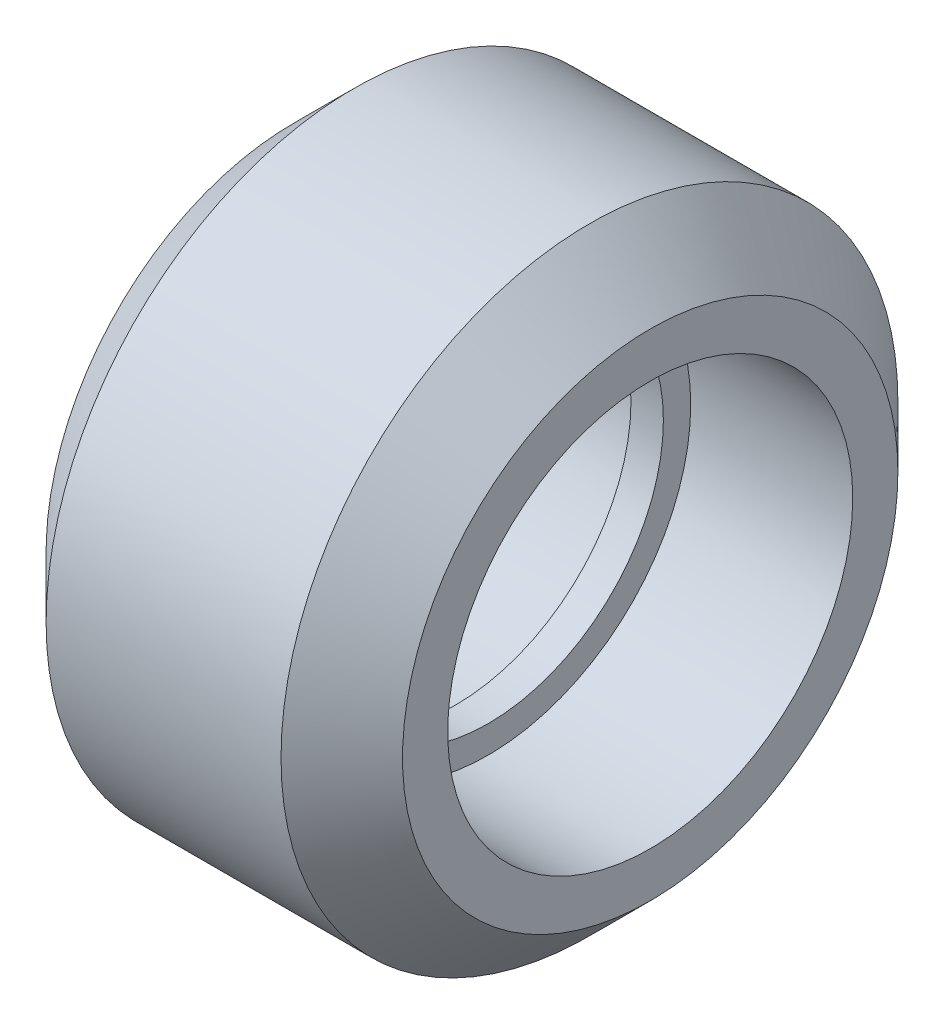
ISO-10303-21;
HEADER;
FILE_DESCRIPTION(('STEP AP214'),'2;1');
FILE_NAME('part.step','',(''),(''),'','','');
FILE_SCHEMA(('AUTOMOTIVE_DESIGN { 1 0 10303 214 1 1 1 1 }'));
ENDSEC;
DATA;
#1=APPLICATION_CONTEXT('core data for automotive mechanical design processes');
#2=APPLICATION_PROTOCOL_DEFINITION('international standard','automotive_design',2000,#1);
#3=PRODUCT_CONTEXT('',#1,'mechanical');
#4=PRODUCT('Part','Part','',(#3));
#5=PRODUCT_RELATED_PRODUCT_CATEGORY('part','',(#4));
#6=PRODUCT_DEFINITION_FORMATION('','',#4);
#7=PRODUCT_DEFINITION_CONTEXT('part definition',#1,'design');
#8=PRODUCT_DEFINITION('design','',#6,#7);
#9=PRODUCT_DEFINITION_SHAPE('','',#8);
#10=(LENGTH_UNIT() NAMED_UNIT(*) SI_UNIT(.MILLI.,.METRE.));
#11=(NAMED_UNIT(*) PLANE_ANGLE_UNIT() SI_UNIT($,.RADIAN.));
#12=(NAMED_UNIT(*) SI_UNIT($,.STERADIAN.) SOLID_ANGLE_UNIT());
#13=UNCERTAINTY_MEASURE_WITH_UNIT(LENGTH_MEASURE(1.E-05),#10,'distance_accuracy_value','');
#14=(GEOMETRIC_REPRESENTATION_CONTEXT(3) GLOBAL_UNCERTAINTY_ASSIGNED_CONTEXT((#13)) GLOBAL_UNIT_ASSIGNED_CONTEXT((#10,
#11,#12)) REPRESENTATION_CONTEXT('',''));
#15=CARTESIAN_POINT('',(0.,0.,0.));
#16=DIRECTION('',(0.,0.,1.));
#17=DIRECTION('',(1.,0.,0.));
#18=AXIS2_PLACEMENT_3D('',#15,#16,#17);
#19=CARTESIAN_POINT('',(-7.05641805106043,4.30504988008806,-1.64793219454396));
#20=DIRECTION('',(1.,0.,0.));
#21=DIRECTION('',(0.,0.,-1.));
#22=AXIS2_PLACEMENT_3D('',#19,#20,#21);
#23=PLANE('',#22);
#24=CARTESIAN_POINT('',(-7.05641805106043,4.30504988008806,-1.64793219454396));
#25=DIRECTION('',(1.,0.,0.));
#26=DIRECTION('',(0.,0.,-1.));
#27=AXIS2_PLACEMENT_3D('',#24,#25,#26);
#28=CIRCLE('',#27,6.11499999999999);
#29=CARTESIAN_POINT('',(-7.05641805106043,4.30504988008806,-7.76293219454395));
#30=VERTEX_POINT('',#29);
#31=EDGE_CURVE('E21',#30,#30,#28,.F.);
#32=ORIENTED_EDGE('',*,*,#31,.T.);
#33=EDGE_LOOP('',(#32));
#34=FACE_BOUND('',#33,.T.);
#35=CARTESIAN_POINT('',(-7.05641805106043,4.30504988008806,-1.64793219454396));
#36=DIRECTION('',(1.,0.,0.));
#37=DIRECTION('',(0.,0.,-1.));
#38=AXIS2_PLACEMENT_3D('',#35,#36,#37);
#39=CIRCLE('',#38,5.);
#40=CARTESIAN_POINT('',(-7.05641805106043,4.30504988008806,-6.64793219454396));
#41=VERTEX_POINT('',#40);
#42=EDGE_CURVE('E38',#41,#41,#39,.T.);
#43=ORIENTED_EDGE('',*,*,#42,.T.);
#44=EDGE_LOOP('',(#43));
#45=FACE_BOUND('',#44,.T.);
#46=ADVANCED_FACE('F14',(#34,#45),#23,.F.);
#47=CARTESIAN_POINT('',(1.74358194893957,4.30504988008806,-1.64793219454396));
#48=DIRECTION('',(-1.,0.,0.));
#49=DIRECTION('',(0.,0.,1.));
#50=AXIS2_PLACEMENT_3D('',#47,#48,#49);
#51=CYLINDRICAL_SURFACE('',#50,7.615);
#52=CARTESIAN_POINT('',(-5.55641805106042,4.30504988008806,-1.64793219454396));
#53=DIRECTION('',(1.,0.,0.));
#54=DIRECTION('',(0.,0.,-1.));
#55=AXIS2_PLACEMENT_3D('',#52,#53,#54);
#56=CIRCLE('',#55,7.615);
#57=CARTESIAN_POINT('',(-5.55641805106042,4.30504988008806,-9.26293219454396));
#58=VERTEX_POINT('',#57);
#59=EDGE_CURVE('E25',#58,#58,#56,.T.);
#60=ORIENTED_EDGE('',*,*,#59,.T.);
#61=EDGE_LOOP('',(#60));
#62=FACE_BOUND('',#61,.T.);
#63=CARTESIAN_POINT('',(0.243581948939564,4.30504988008806,-1.64793219454396));
#64=DIRECTION('',(1.,0.,0.));
#65=DIRECTION('',(0.,0.,-1.));
#66=AXIS2_PLACEMENT_3D('',#63,#64,#65);
#67=CIRCLE('',#66,7.615);
#68=CARTESIAN_POINT('',(0.243581948939564,4.30504988008806,-9.26293219454396));
#69=VERTEX_POINT('',#68);
#70=EDGE_CURVE('E29',#69,#69,#67,.F.);
#71=ORIENTED_EDGE('',*,*,#70,.T.);
#72=EDGE_LOOP('',(#71));
#73=FACE_BOUND('',#72,.T.);
#74=ADVANCED_FACE('F70',(#62,#73),#51,.T.);
#75=CARTESIAN_POINT('',(1.74358194893957,4.30504988008806,-1.64793219454396));
#76=DIRECTION('',(1.,0.,0.));
#77=DIRECTION('',(0.,0.,-1.));
#78=AXIS2_PLACEMENT_3D('',#75,#76,#77);
#79=PLANE('',#78);
#80=CARTESIAN_POINT('',(1.74358194893957,4.30504988008806,-1.64793219454396));
#81=DIRECTION('',(1.,0.,0.));
#82=DIRECTION('',(0.,0.,-1.));
#83=AXIS2_PLACEMENT_3D('',#80,#81,#82);
#84=CIRCLE('',#83,6.11499999999999);
#85=CARTESIAN_POINT('',(1.74358194893957,4.30504988008806,-7.76293219454394));
#86=VERTEX_POINT('',#85);
#87=EDGE_CURVE('E9',#86,#86,#84,.T.);
#88=ORIENTED_EDGE('',*,*,#87,.T.);
#89=EDGE_LOOP('',(#88));
#90=FACE_BOUND('',#89,.T.);
#91=CARTESIAN_POINT('',(1.74358194893957,4.30504988008806,-1.64793219454396));
#92=DIRECTION('',(1.,0.,0.));
#93=DIRECTION('',(0.,0.,-1.));
#94=AXIS2_PLACEMENT_3D('',#91,#92,#93);
#95=CIRCLE('',#94,5.);
#96=CARTESIAN_POINT('',(1.74358194893957,4.30504988008806,-6.64793219454396));
#97=VERTEX_POINT('',#96);
#98=EDGE_CURVE('E40',#97,#97,#95,.T.);
#99=ORIENTED_EDGE('',*,*,#98,.F.);
#100=EDGE_LOOP('',(#99));
#101=FACE_BOUND('',#100,.T.);
#102=ADVANCED_FACE('F65',(#90,#101),#79,.T.);
#103=CARTESIAN_POINT('',(-2.25641805106043,4.30504988008806,-1.64793219454396));
#104=DIRECTION('',(1.,0.,0.));
#105=DIRECTION('',(0.,0.,-1.));
#106=AXIS2_PLACEMENT_3D('',#103,#104,#105);
#107=CYLINDRICAL_SURFACE('',#106,5.);
#108=CARTESIAN_POINT('',(-2.25641805106043,4.30504988008806,-1.64793219454396));
#109=DIRECTION('',(1.,0.,0.));
#110=DIRECTION('',(0.,0.,-1.));
#111=AXIS2_PLACEMENT_3D('',#108,#109,#110);
#112=CIRCLE('',#111,5.);
#113=CARTESIAN_POINT('',(-2.25641805106043,4.30504988008806,-6.64793219454396));
#114=VERTEX_POINT('',#113);
#115=EDGE_CURVE('E34',#114,#114,#112,.T.);
#116=ORIENTED_EDGE('',*,*,#115,.F.);
#117=EDGE_LOOP('',(#116));
#118=FACE_BOUND('',#117,.T.);
#119=ORIENTED_EDGE('',*,*,#98,.T.);
#120=EDGE_LOOP('',(#119));
#121=FACE_BOUND('',#120,.T.);
#122=ADVANCED_FACE('F59',(#118,#121),#107,.F.);
#123=CARTESIAN_POINT('',(-2.25641805106043,4.30504988008806,-1.64793219454396));
#124=DIRECTION('',(1.,0.,0.));
#125=DIRECTION('',(0.,0.,-1.));
#126=AXIS2_PLACEMENT_3D('',#123,#124,#125);
#127=PLANE('',#126);
#128=CARTESIAN_POINT('',(-2.25641805106043,4.30504988008806,-1.64793219454396));
#129=DIRECTION('',(1.,0.,0.));
#130=DIRECTION('',(0.,0.,-1.));
#131=AXIS2_PLACEMENT_3D('',#128,#129,#130);
#132=CIRCLE('',#131,4.325);
#133=CARTESIAN_POINT('',(-2.25641805106043,4.30504988008806,-5.97293219454396));
#134=VERTEX_POINT('',#133);
#135=EDGE_CURVE('E39',#134,#134,#132,.T.);
#136=ORIENTED_EDGE('',*,*,#135,.F.);
#137=EDGE_LOOP('',(#136));
#138=FACE_BOUND('',#137,.T.);
#139=ORIENTED_EDGE('',*,*,#115,.T.);
#140=EDGE_LOOP('',(#139));
#141=FACE_BOUND('',#140,.T.);
#142=ADVANCED_FACE('F55',(#138,#141),#127,.T.);
#143=CARTESIAN_POINT('',(-3.05641805106043,4.30504988008806,-1.64793219454396));
#144=DIRECTION('',(-1.,0.,0.));
#145=DIRECTION('',(0.,0.,1.));
#146=AXIS2_PLACEMENT_3D('',#143,#144,#145);
#147=CYLINDRICAL_SURFACE('',#146,5.);
#148=CARTESIAN_POINT('',(-3.05641805106043,4.30504988008806,-1.64793219454396));
#149=DIRECTION('',(1.,0.,0.));
#150=DIRECTION('',(0.,0.,-1.));
#151=AXIS2_PLACEMENT_3D('',#148,#149,#150);
#152=CIRCLE('',#151,5.);
#153=CARTESIAN_POINT('',(-3.05641805106043,4.30504988008806,-6.64793219454396));
#154=VERTEX_POINT('',#153);
#155=EDGE_CURVE('E43',#154,#154,#152,.T.);
#156=ORIENTED_EDGE('',*,*,#155,.T.);
#157=EDGE_LOOP('',(#156));
#158=FACE_BOUND('',#157,.T.);
#159=ORIENTED_EDGE('',*,*,#42,.F.);
#160=EDGE_LOOP('',(#159));
#161=FACE_BOUND('',#160,.T.);
#162=ADVANCED_FACE('F58',(#158,#161),#147,.F.);
#163=CARTESIAN_POINT('',(-3.05641805106043,4.30504988008806,-1.64793219454396));
#164=DIRECTION('',(-1.,0.,0.));
#165=DIRECTION('',(0.,0.,-1.));
#166=AXIS2_PLACEMENT_3D('',#163,#164,#165);
#167=PLANE('',#166);
#168=CARTESIAN_POINT('',(-3.05641805106043,4.30504988008806,-1.64793219454396));
#169=DIRECTION('',(-1.,0.,0.));
#170=DIRECTION('',(0.,0.,1.));
#171=AXIS2_PLACEMENT_3D('',#168,#169,#170);
#172=CIRCLE('',#171,4.325);
#173=CARTESIAN_POINT('',(-3.05641805106043,4.30504988008806,2.67706780545605));
#174=VERTEX_POINT('',#173);
#175=EDGE_CURVE('E35',#174,#174,#172,.T.);
#176=ORIENTED_EDGE('',*,*,#175,.F.);
#177=EDGE_LOOP('',(#176));
#178=FACE_BOUND('',#177,.T.);
#179=ORIENTED_EDGE('',*,*,#155,.F.);
#180=EDGE_LOOP('',(#179));
#181=FACE_BOUND('',#180,.T.);
#182=ADVANCED_FACE('F91',(#178,#181),#167,.T.);
#183=CARTESIAN_POINT('',(-3.25641805106043,4.30504988008806,-1.64793219454396));
#184=DIRECTION('',(1.,0.,0.));
#185=DIRECTION('',(0.,0.,-1.));
#186=AXIS2_PLACEMENT_3D('',#183,#184,#185);
#187=CYLINDRICAL_SURFACE('',#186,4.325);
#188=ORIENTED_EDGE('',*,*,#175,.T.);
#189=EDGE_LOOP('',(#188));
#190=FACE_BOUND('',#189,.T.);
#191=ORIENTED_EDGE('',*,*,#135,.T.);
#192=EDGE_LOOP('',(#191));
#193=FACE_BOUND('',#192,.T.);
#194=ADVANCED_FACE('F53',(#190,#193),#187,.F.);
#195=CARTESIAN_POINT('',(-5.55641805106042,4.30504988008806,-1.64793219454396));
#196=DIRECTION('',(1.,0.,0.));
#197=DIRECTION('',(0.,0.,-1.));
#198=AXIS2_PLACEMENT_3D('',#195,#196,#197);
#199=CONICAL_SURFACE('',#198,7.615,0.785398163397448);
#200=ORIENTED_EDGE('',*,*,#31,.F.);
#201=EDGE_LOOP('',(#200));
#202=FACE_BOUND('',#201,.T.);
#203=ORIENTED_EDGE('',*,*,#59,.F.);
#204=EDGE_LOOP('',(#203));
#205=FACE_BOUND('',#204,.T.);
#206=ADVANCED_FACE('F83',(#202,#205),#199,.T.);
#207=CARTESIAN_POINT('',(1.74358194893957,4.30504988008806,-1.64793219454396));
#208=DIRECTION('',(-1.,0.,0.));
#209=DIRECTION('',(0.,0.,1.));
#210=AXIS2_PLACEMENT_3D('',#207,#208,#209);
#211=CONICAL_SURFACE('',#210,6.11499999999999,0.785398163397449);
#212=ORIENTED_EDGE('',*,*,#70,.F.);
#213=EDGE_LOOP('',(#212));
#214=FACE_BOUND('',#213,.T.);
#215=ORIENTED_EDGE('',*,*,#87,.F.);
#216=EDGE_LOOP('',(#215));
#217=FACE_BOUND('',#216,.T.);
#218=ADVANCED_FACE('F16',(#214,#217),#211,.T.);
#219=CLOSED_SHELL('',(#46,#74,#102,#122,#142,#162,#182,#194,#206,#218));
#220=MANIFOLD_SOLID_BREP('B1',#219);
#221=ADVANCED_BREP_SHAPE_REPRESENTATION('',(#18,#220),#14);
#222=SHAPE_DEFINITION_REPRESENTATION(#9,#221);
ENDSEC;
END-ISO-10303-21;
